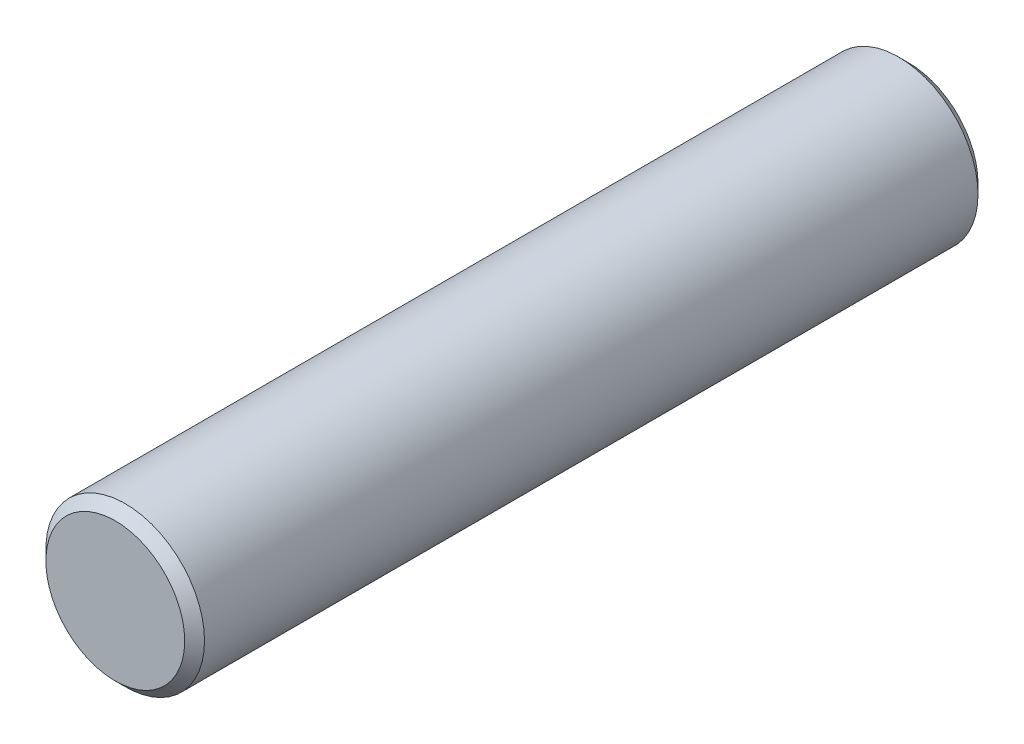
ISO-10303-21;
HEADER;
FILE_DESCRIPTION(('STEP AP214'),'2;1');
FILE_NAME('part.step','',(''),(''),'','','');
FILE_SCHEMA(('AUTOMOTIVE_DESIGN { 1 0 10303 214 1 1 1 1 }'));
ENDSEC;
DATA;
#1=APPLICATION_CONTEXT('core data for automotive mechanical design processes');
#2=APPLICATION_PROTOCOL_DEFINITION('international standard','automotive_design',2000,#1);
#3=PRODUCT_CONTEXT('',#1,'mechanical');
#4=PRODUCT('Part','Part','',(#3));
#5=PRODUCT_RELATED_PRODUCT_CATEGORY('part','',(#4));
#6=PRODUCT_DEFINITION_FORMATION('','',#4);
#7=PRODUCT_DEFINITION_CONTEXT('part definition',#1,'design');
#8=PRODUCT_DEFINITION('design','',#6,#7);
#9=PRODUCT_DEFINITION_SHAPE('','',#8);
#10=(LENGTH_UNIT() NAMED_UNIT(*) SI_UNIT(.MILLI.,.METRE.));
#11=(NAMED_UNIT(*) PLANE_ANGLE_UNIT() SI_UNIT($,.RADIAN.));
#12=(NAMED_UNIT(*) SI_UNIT($,.STERADIAN.) SOLID_ANGLE_UNIT());
#13=UNCERTAINTY_MEASURE_WITH_UNIT(LENGTH_MEASURE(1.E-05),#10,'distance_accuracy_value','');
#14=(GEOMETRIC_REPRESENTATION_CONTEXT(3) GLOBAL_UNCERTAINTY_ASSIGNED_CONTEXT((#13)) GLOBAL_UNIT_ASSIGNED_CONTEXT((#10,
#11,#12)) REPRESENTATION_CONTEXT('',''));
#15=CARTESIAN_POINT('',(0.,0.,0.));
#16=DIRECTION('',(0.,0.,1.));
#17=DIRECTION('',(1.,0.,0.));
#18=AXIS2_PLACEMENT_3D('',#15,#16,#17);
#19=CARTESIAN_POINT('',(0.,0.,40.));
#20=DIRECTION('',(0.,0.,-1.));
#21=DIRECTION('',(-1.,0.,0.));
#22=AXIS2_PLACEMENT_3D('',#19,#20,#21);
#23=CYLINDRICAL_SURFACE('',#22,4.);
#24=CARTESIAN_POINT('',(0.,0.,0.500000000000007));
#25=DIRECTION('',(0.,0.,1.));
#26=DIRECTION('',(1.,0.,0.));
#27=AXIS2_PLACEMENT_3D('',#24,#25,#26);
#28=CIRCLE('',#27,4.);
#29=CARTESIAN_POINT('',(4.,0.,0.500000000000007));
#30=VERTEX_POINT('',#29);
#31=EDGE_CURVE('E52',#30,#30,#28,.T.);
#32=ORIENTED_EDGE('',*,*,#31,.T.);
#33=EDGE_LOOP('',(#32));
#34=FACE_BOUND('',#33,.T.);
#35=CARTESIAN_POINT('',(0.,0.,39.5));
#36=DIRECTION('',(0.,0.,1.));
#37=DIRECTION('',(1.,0.,0.));
#38=AXIS2_PLACEMENT_3D('',#35,#36,#37);
#39=CIRCLE('',#38,4.);
#40=CARTESIAN_POINT('',(4.,0.,39.5));
#41=VERTEX_POINT('',#40);
#42=EDGE_CURVE('E57',#41,#41,#39,.F.);
#43=ORIENTED_EDGE('',*,*,#42,.T.);
#44=EDGE_LOOP('',(#43));
#45=FACE_BOUND('',#44,.T.);
#46=ADVANCED_FACE('F39',(#34,#45),#23,.T.);
#47=CARTESIAN_POINT('',(0.,0.,40.));
#48=DIRECTION('',(0.,0.,1.));
#49=DIRECTION('',(1.,0.,0.));
#50=AXIS2_PLACEMENT_3D('',#47,#48,#49);
#51=PLANE('',#50);
#52=CARTESIAN_POINT('',(0.,0.,40.));
#53=DIRECTION('',(0.,0.,1.));
#54=DIRECTION('',(1.,0.,0.));
#55=AXIS2_PLACEMENT_3D('',#52,#53,#54);
#56=CIRCLE('',#55,3.50000000000001);
#57=CARTESIAN_POINT('',(3.50000000000001,0.,40.));
#58=VERTEX_POINT('',#57);
#59=EDGE_CURVE('E10',#58,#58,#56,.T.);
#60=ORIENTED_EDGE('',*,*,#59,.T.);
#61=EDGE_LOOP('',(#60));
#62=FACE_BOUND('',#61,.T.);
#63=ADVANCED_FACE('F74',(#62),#51,.T.);
#64=CARTESIAN_POINT('',(0.,0.,0.));
#65=DIRECTION('',(0.,0.,1.));
#66=DIRECTION('',(1.,0.,0.));
#67=AXIS2_PLACEMENT_3D('',#64,#65,#66);
#68=PLANE('',#67);
#69=CARTESIAN_POINT('',(0.,0.,0.));
#70=DIRECTION('',(0.,0.,1.));
#71=DIRECTION('',(1.,0.,0.));
#72=AXIS2_PLACEMENT_3D('',#69,#70,#71);
#73=CIRCLE('',#72,3.5);
#74=CARTESIAN_POINT('',(3.5,0.,0.));
#75=VERTEX_POINT('',#74);
#76=EDGE_CURVE('E47',#75,#75,#73,.F.);
#77=ORIENTED_EDGE('',*,*,#76,.T.);
#78=EDGE_LOOP('',(#77));
#79=FACE_BOUND('',#78,.T.);
#80=ADVANCED_FACE('F71',(#79),#68,.F.);
#81=CARTESIAN_POINT('',(0.,0.,0.500000000000007));
#82=DIRECTION('',(0.,0.,1.));
#83=DIRECTION('',(1.,0.,0.));
#84=AXIS2_PLACEMENT_3D('',#81,#82,#83);
#85=CONICAL_SURFACE('',#84,4.,0.785398163397448);
#86=ORIENTED_EDGE('',*,*,#76,.F.);
#87=EDGE_LOOP('',(#86));
#88=FACE_BOUND('',#87,.T.);
#89=ORIENTED_EDGE('',*,*,#31,.F.);
#90=EDGE_LOOP('',(#89));
#91=FACE_BOUND('',#90,.T.);
#92=ADVANCED_FACE('F67',(#88,#91),#85,.T.);
#93=CARTESIAN_POINT('',(0.,0.,40.));
#94=DIRECTION('',(0.,0.,-1.));
#95=DIRECTION('',(-1.,0.,0.));
#96=AXIS2_PLACEMENT_3D('',#93,#94,#95);
#97=CONICAL_SURFACE('',#96,3.50000000000001,0.785398163397452);
#98=ORIENTED_EDGE('',*,*,#42,.F.);
#99=EDGE_LOOP('',(#98));
#100=FACE_BOUND('',#99,.T.);
#101=ORIENTED_EDGE('',*,*,#59,.F.);
#102=EDGE_LOOP('',(#101));
#103=FACE_BOUND('',#102,.T.);
#104=ADVANCED_FACE('F41',(#100,#103),#97,.T.);
#105=CLOSED_SHELL('',(#46,#63,#80,#92,#104));
#106=MANIFOLD_SOLID_BREP('B2',#105);
#107=ADVANCED_BREP_SHAPE_REPRESENTATION('',(#18,#106),#14);
#108=SHAPE_DEFINITION_REPRESENTATION(#9,#107);
ENDSEC;
END-ISO-10303-21;
